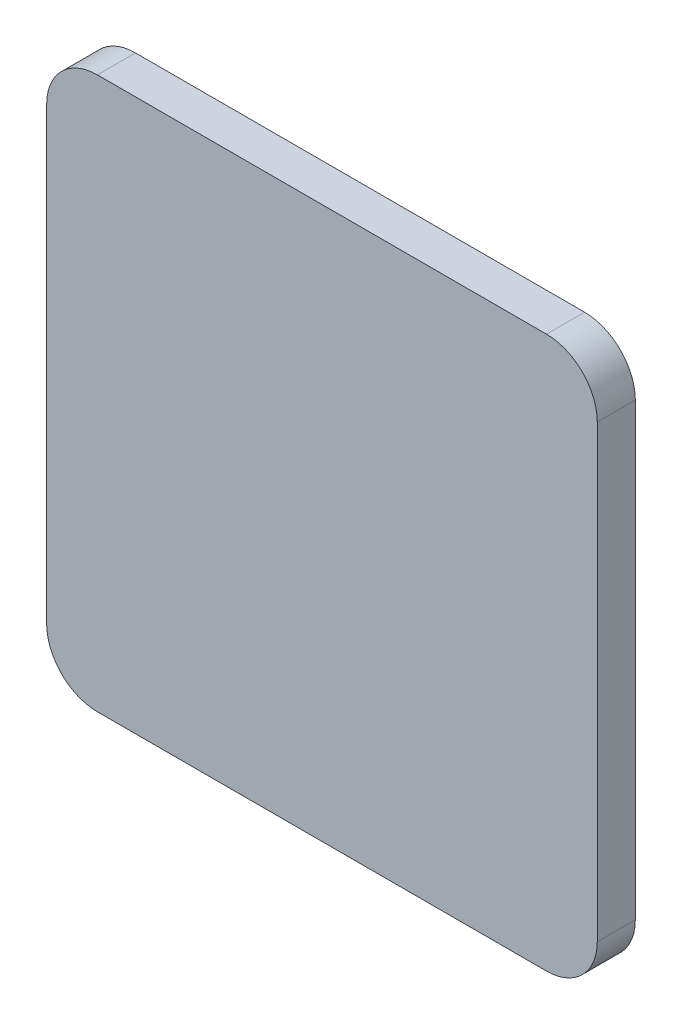
ISO-10303-21;
HEADER;
FILE_DESCRIPTION(('STEP AP214'),'2;1');
FILE_NAME('part.step','',(''),(''),'','','');
FILE_SCHEMA(('AUTOMOTIVE_DESIGN { 1 0 10303 214 1 1 1 1 }'));
ENDSEC;
DATA;
#1=APPLICATION_CONTEXT('core data for automotive mechanical design processes');
#2=APPLICATION_PROTOCOL_DEFINITION('international standard','automotive_design',2000,#1);
#3=PRODUCT_CONTEXT('',#1,'mechanical');
#4=PRODUCT('Part','Part','',(#3));
#5=PRODUCT_RELATED_PRODUCT_CATEGORY('part','',(#4));
#6=PRODUCT_DEFINITION_FORMATION('','',#4);
#7=PRODUCT_DEFINITION_CONTEXT('part definition',#1,'design');
#8=PRODUCT_DEFINITION('design','',#6,#7);
#9=PRODUCT_DEFINITION_SHAPE('','',#8);
#10=(LENGTH_UNIT() NAMED_UNIT(*) SI_UNIT(.MILLI.,.METRE.));
#11=(NAMED_UNIT(*) PLANE_ANGLE_UNIT() SI_UNIT($,.RADIAN.));
#12=(NAMED_UNIT(*) SI_UNIT($,.STERADIAN.) SOLID_ANGLE_UNIT());
#13=UNCERTAINTY_MEASURE_WITH_UNIT(LENGTH_MEASURE(1.E-05),#10,'distance_accuracy_value','');
#14=(GEOMETRIC_REPRESENTATION_CONTEXT(3) GLOBAL_UNCERTAINTY_ASSIGNED_CONTEXT((#13)) GLOBAL_UNIT_ASSIGNED_CONTEXT((#10,
#11,#12)) REPRESENTATION_CONTEXT('',''));
#15=CARTESIAN_POINT('',(0.,0.,0.));
#16=DIRECTION('',(0.,0.,1.));
#17=DIRECTION('',(1.,0.,0.));
#18=AXIS2_PLACEMENT_3D('',#15,#16,#17);
#19=CARTESIAN_POINT('',(0.,0.,1.5));
#20=DIRECTION('',(1.,0.,0.));
#21=DIRECTION('',(0.,0.,-1.));
#22=AXIS2_PLACEMENT_3D('',#19,#20,#21);
#23=PLANE('',#22);
#24=DIRECTION('',(0.,-1.,0.));
#25=VECTOR('',#24,1.);
#26=CARTESIAN_POINT('',(0.,0.,1.5));
#27=LINE('',#26,#25);
#28=CARTESIAN_POINT('',(0.,19.740751921482,1.5));
#29=VERTEX_POINT('',#28);
#30=CARTESIAN_POINT('',(0.,2.,1.5));
#31=VERTEX_POINT('',#30);
#32=EDGE_CURVE('E126',#29,#31,#27,.T.);
#33=ORIENTED_EDGE('',*,*,#32,.F.);
#34=DIRECTION('',(0.,0.,-1.));
#35=VECTOR('',#34,1.);
#36=CARTESIAN_POINT('',(0.,19.740751921482,1.5));
#37=LINE('',#36,#35);
#38=CARTESIAN_POINT('',(0.,19.740751921482,0.));
#39=VERTEX_POINT('',#38);
#40=EDGE_CURVE('E152',#29,#39,#37,.T.);
#41=ORIENTED_EDGE('',*,*,#40,.T.);
#42=DIRECTION('',(0.,-1.,0.));
#43=VECTOR('',#42,1.);
#44=CARTESIAN_POINT('',(0.,0.,0.));
#45=LINE('',#44,#43);
#46=CARTESIAN_POINT('',(0.,2.,0.));
#47=VERTEX_POINT('',#46);
#48=EDGE_CURVE('E158',#39,#47,#45,.T.);
#49=ORIENTED_EDGE('',*,*,#48,.T.);
#50=DIRECTION('',(0.,0.,-1.));
#51=VECTOR('',#50,1.);
#52=CARTESIAN_POINT('',(0.,2.,1.5));
#53=LINE('',#52,#51);
#54=EDGE_CURVE('E150',#47,#31,#53,.F.);
#55=ORIENTED_EDGE('',*,*,#54,.T.);
#56=EDGE_LOOP('',(#33,#41,#49,#55));
#57=FACE_BOUND('',#56,.T.);
#58=ADVANCED_FACE('F34',(#57),#23,.F.);
#59=CARTESIAN_POINT('',(0.,0.,1.5));
#60=DIRECTION('',(0.,1.,0.));
#61=DIRECTION('',(0.,0.,1.));
#62=AXIS2_PLACEMENT_3D('',#59,#60,#61);
#63=PLANE('',#62);
#64=DIRECTION('',(1.,0.,0.));
#65=VECTOR('',#64,1.);
#66=CARTESIAN_POINT('',(0.,0.,1.5));
#67=LINE('',#66,#65);
#68=CARTESIAN_POINT('',(2.,0.,1.5));
#69=VERTEX_POINT('',#68);
#70=CARTESIAN_POINT('',(19.7002476526568,0.,1.5));
#71=VERTEX_POINT('',#70);
#72=EDGE_CURVE('E129',#69,#71,#67,.T.);
#73=ORIENTED_EDGE('',*,*,#72,.F.);
#74=DIRECTION('',(0.,0.,-1.));
#75=VECTOR('',#74,1.);
#76=CARTESIAN_POINT('',(2.,0.,1.5));
#77=LINE('',#76,#75);
#78=CARTESIAN_POINT('',(2.,0.,0.));
#79=VERTEX_POINT('',#78);
#80=EDGE_CURVE('E11',#69,#79,#77,.T.);
#81=ORIENTED_EDGE('',*,*,#80,.T.);
#82=DIRECTION('',(1.,0.,0.));
#83=VECTOR('',#82,1.);
#84=CARTESIAN_POINT('',(0.,0.,0.));
#85=LINE('',#84,#83);
#86=CARTESIAN_POINT('',(19.7002476526568,0.,0.));
#87=VERTEX_POINT('',#86);
#88=EDGE_CURVE('E131',#79,#87,#85,.T.);
#89=ORIENTED_EDGE('',*,*,#88,.T.);
#90=DIRECTION('',(0.,0.,-1.));
#91=VECTOR('',#90,1.);
#92=CARTESIAN_POINT('',(19.7002476526568,0.,1.5));
#93=LINE('',#92,#91);
#94=EDGE_CURVE('E42',#87,#71,#93,.F.);
#95=ORIENTED_EDGE('',*,*,#94,.T.);
#96=EDGE_LOOP('',(#73,#81,#89,#95));
#97=FACE_BOUND('',#96,.T.);
#98=ADVANCED_FACE('F177',(#97),#63,.F.);
#99=CARTESIAN_POINT('',(21.7002476526568,0.,1.5));
#100=DIRECTION('',(-1.,0.,0.));
#101=DIRECTION('',(0.,0.,1.));
#102=AXIS2_PLACEMENT_3D('',#99,#100,#101);
#103=PLANE('',#102);
#104=DIRECTION('',(0.,1.,0.));
#105=VECTOR('',#104,1.);
#106=CARTESIAN_POINT('',(21.7002476526568,0.,0.));
#107=LINE('',#106,#105);
#108=CARTESIAN_POINT('',(21.7002476526568,2.,0.));
#109=VERTEX_POINT('',#108);
#110=CARTESIAN_POINT('',(21.7002476526568,19.740751921482,0.));
#111=VERTEX_POINT('',#110);
#112=EDGE_CURVE('E127',#109,#111,#107,.T.);
#113=ORIENTED_EDGE('',*,*,#112,.T.);
#114=DIRECTION('',(0.,0.,-1.));
#115=VECTOR('',#114,1.);
#116=CARTESIAN_POINT('',(21.7002476526568,19.740751921482,1.5));
#117=LINE('',#116,#115);
#118=CARTESIAN_POINT('',(21.7002476526568,19.740751921482,1.5));
#119=VERTEX_POINT('',#118);
#120=EDGE_CURVE('E105',#111,#119,#117,.F.);
#121=ORIENTED_EDGE('',*,*,#120,.T.);
#122=DIRECTION('',(0.,1.,0.));
#123=VECTOR('',#122,1.);
#124=CARTESIAN_POINT('',(21.7002476526568,0.,1.5));
#125=LINE('',#124,#123);
#126=CARTESIAN_POINT('',(21.7002476526568,2.,1.5));
#127=VERTEX_POINT('',#126);
#128=EDGE_CURVE('E166',#127,#119,#125,.T.);
#129=ORIENTED_EDGE('',*,*,#128,.F.);
#130=DIRECTION('',(0.,0.,-1.));
#131=VECTOR('',#130,1.);
#132=CARTESIAN_POINT('',(21.7002476526568,2.,1.5));
#133=LINE('',#132,#131);
#134=EDGE_CURVE('E110',#127,#109,#133,.T.);
#135=ORIENTED_EDGE('',*,*,#134,.T.);
#136=EDGE_LOOP('',(#113,#121,#129,#135));
#137=FACE_BOUND('',#136,.T.);
#138=ADVANCED_FACE('F176',(#137),#103,.F.);
#139=CARTESIAN_POINT('',(0.,21.740751921482,1.5));
#140=DIRECTION('',(0.,-1.,0.));
#141=DIRECTION('',(0.,0.,-1.));
#142=AXIS2_PLACEMENT_3D('',#139,#140,#141);
#143=PLANE('',#142);
#144=DIRECTION('',(-1.,0.,0.));
#145=VECTOR('',#144,1.);
#146=CARTESIAN_POINT('',(0.,21.740751921482,1.5));
#147=LINE('',#146,#145);
#148=CARTESIAN_POINT('',(19.7002476526568,21.740751921482,1.5));
#149=VERTEX_POINT('',#148);
#150=CARTESIAN_POINT('',(2.,21.740751921482,1.5));
#151=VERTEX_POINT('',#150);
#152=EDGE_CURVE('E120',#149,#151,#147,.T.);
#153=ORIENTED_EDGE('',*,*,#152,.F.);
#154=DIRECTION('',(0.,0.,-1.));
#155=VECTOR('',#154,1.);
#156=CARTESIAN_POINT('',(19.7002476526568,21.740751921482,1.5));
#157=LINE('',#156,#155);
#158=CARTESIAN_POINT('',(19.7002476526568,21.740751921482,0.));
#159=VERTEX_POINT('',#158);
#160=EDGE_CURVE('E104',#149,#159,#157,.T.);
#161=ORIENTED_EDGE('',*,*,#160,.T.);
#162=DIRECTION('',(-1.,0.,0.));
#163=VECTOR('',#162,1.);
#164=CARTESIAN_POINT('',(0.,21.740751921482,0.));
#165=LINE('',#164,#163);
#166=CARTESIAN_POINT('',(2.,21.740751921482,0.));
#167=VERTEX_POINT('',#166);
#168=EDGE_CURVE('E117',#159,#167,#165,.T.);
#169=ORIENTED_EDGE('',*,*,#168,.T.);
#170=DIRECTION('',(0.,0.,-1.));
#171=VECTOR('',#170,1.);
#172=CARTESIAN_POINT('',(2.,21.740751921482,1.5));
#173=LINE('',#172,#171);
#174=EDGE_CURVE('E122',#167,#151,#173,.F.);
#175=ORIENTED_EDGE('',*,*,#174,.T.);
#176=EDGE_LOOP('',(#153,#161,#169,#175));
#177=FACE_BOUND('',#176,.T.);
#178=ADVANCED_FACE('F116',(#177),#143,.F.);
#179=CARTESIAN_POINT('',(0.,0.,1.5));
#180=DIRECTION('',(0.,0.,-1.));
#181=DIRECTION('',(-1.,0.,0.));
#182=AXIS2_PLACEMENT_3D('',#179,#180,#181);
#183=PLANE('',#182);
#184=ORIENTED_EDGE('',*,*,#128,.T.);
#185=CARTESIAN_POINT('',(19.7002476526568,19.740751921482,1.5));
#186=DIRECTION('',(0.,0.,-1.));
#187=DIRECTION('',(-1.,0.,0.));
#188=AXIS2_PLACEMENT_3D('',#185,#186,#187);
#189=CIRCLE('',#188,2.);
#190=EDGE_CURVE('E148',#119,#149,#189,.F.);
#191=ORIENTED_EDGE('',*,*,#190,.T.);
#192=ORIENTED_EDGE('',*,*,#152,.T.);
#193=CARTESIAN_POINT('',(2.,19.740751921482,1.5));
#194=DIRECTION('',(0.,0.,-1.));
#195=DIRECTION('',(-1.,0.,0.));
#196=AXIS2_PLACEMENT_3D('',#193,#194,#195);
#197=CIRCLE('',#196,2.);
#198=EDGE_CURVE('E146',#151,#29,#197,.F.);
#199=ORIENTED_EDGE('',*,*,#198,.T.);
#200=ORIENTED_EDGE('',*,*,#32,.T.);
#201=CARTESIAN_POINT('',(2.,2.,1.5));
#202=DIRECTION('',(0.,0.,-1.));
#203=DIRECTION('',(-1.,0.,0.));
#204=AXIS2_PLACEMENT_3D('',#201,#202,#203);
#205=CIRCLE('',#204,2.);
#206=EDGE_CURVE('E55',#31,#69,#205,.F.);
#207=ORIENTED_EDGE('',*,*,#206,.T.);
#208=ORIENTED_EDGE('',*,*,#72,.T.);
#209=CARTESIAN_POINT('',(19.7002476526568,2.,1.5));
#210=DIRECTION('',(0.,0.,-1.));
#211=DIRECTION('',(-1.,0.,0.));
#212=AXIS2_PLACEMENT_3D('',#209,#210,#211);
#213=CIRCLE('',#212,2.);
#214=EDGE_CURVE('E143',#71,#127,#213,.F.);
#215=ORIENTED_EDGE('',*,*,#214,.T.);
#216=EDGE_LOOP('',(#184,#191,#192,#199,#200,#207,#208,#215));
#217=FACE_BOUND('',#216,.T.);
#218=ADVANCED_FACE('F170',(#217),#183,.F.);
#219=CARTESIAN_POINT('',(0.,0.,0.));
#220=DIRECTION('',(0.,0.,-1.));
#221=DIRECTION('',(-1.,0.,0.));
#222=AXIS2_PLACEMENT_3D('',#219,#220,#221);
#223=PLANE('',#222);
#224=ORIENTED_EDGE('',*,*,#168,.F.);
#225=CARTESIAN_POINT('',(19.7002476526568,19.740751921482,0.));
#226=DIRECTION('',(0.,0.,-1.));
#227=DIRECTION('',(-1.,0.,0.));
#228=AXIS2_PLACEMENT_3D('',#225,#226,#227);
#229=CIRCLE('',#228,2.);
#230=EDGE_CURVE('E100',#159,#111,#229,.T.);
#231=ORIENTED_EDGE('',*,*,#230,.T.);
#232=ORIENTED_EDGE('',*,*,#112,.F.);
#233=CARTESIAN_POINT('',(19.7002476526568,2.,0.));
#234=DIRECTION('',(0.,0.,-1.));
#235=DIRECTION('',(-1.,0.,0.));
#236=AXIS2_PLACEMENT_3D('',#233,#234,#235);
#237=CIRCLE('',#236,2.);
#238=EDGE_CURVE('E121',#109,#87,#237,.T.);
#239=ORIENTED_EDGE('',*,*,#238,.T.);
#240=ORIENTED_EDGE('',*,*,#88,.F.);
#241=CARTESIAN_POINT('',(2.,2.,0.));
#242=DIRECTION('',(0.,0.,-1.));
#243=DIRECTION('',(-1.,0.,0.));
#244=AXIS2_PLACEMENT_3D('',#241,#242,#243);
#245=CIRCLE('',#244,2.);
#246=EDGE_CURVE('E137',#79,#47,#245,.T.);
#247=ORIENTED_EDGE('',*,*,#246,.T.);
#248=ORIENTED_EDGE('',*,*,#48,.F.);
#249=CARTESIAN_POINT('',(2.,19.740751921482,0.));
#250=DIRECTION('',(0.,0.,-1.));
#251=DIRECTION('',(-1.,0.,0.));
#252=AXIS2_PLACEMENT_3D('',#249,#250,#251);
#253=CIRCLE('',#252,2.);
#254=EDGE_CURVE('E111',#39,#167,#253,.T.);
#255=ORIENTED_EDGE('',*,*,#254,.T.);
#256=EDGE_LOOP('',(#224,#231,#232,#239,#240,#247,#248,#255));
#257=FACE_BOUND('',#256,.T.);
#258=ADVANCED_FACE('F124',(#257),#223,.T.);
#259=CARTESIAN_POINT('',(19.7002476526568,19.740751921482,1.5));
#260=DIRECTION('',(0.,0.,-1.));
#261=DIRECTION('',(-1.,0.,0.));
#262=AXIS2_PLACEMENT_3D('',#259,#260,#261);
#263=CYLINDRICAL_SURFACE('',#262,2.);
#264=ORIENTED_EDGE('',*,*,#190,.F.);
#265=ORIENTED_EDGE('',*,*,#120,.F.);
#266=ORIENTED_EDGE('',*,*,#230,.F.);
#267=ORIENTED_EDGE('',*,*,#160,.F.);
#268=EDGE_LOOP('',(#264,#265,#266,#267));
#269=FACE_BOUND('',#268,.T.);
#270=ADVANCED_FACE('F103',(#269),#263,.T.);
#271=CARTESIAN_POINT('',(2.,19.740751921482,1.5));
#272=DIRECTION('',(0.,0.,-1.));
#273=DIRECTION('',(-1.,0.,0.));
#274=AXIS2_PLACEMENT_3D('',#271,#272,#273);
#275=CYLINDRICAL_SURFACE('',#274,2.);
#276=ORIENTED_EDGE('',*,*,#198,.F.);
#277=ORIENTED_EDGE('',*,*,#174,.F.);
#278=ORIENTED_EDGE('',*,*,#254,.F.);
#279=ORIENTED_EDGE('',*,*,#40,.F.);
#280=EDGE_LOOP('',(#276,#277,#278,#279));
#281=FACE_BOUND('',#280,.T.);
#282=ADVANCED_FACE('F180',(#281),#275,.T.);
#283=CARTESIAN_POINT('',(2.,2.,1.5));
#284=DIRECTION('',(0.,0.,-1.));
#285=DIRECTION('',(-1.,0.,0.));
#286=AXIS2_PLACEMENT_3D('',#283,#284,#285);
#287=CYLINDRICAL_SURFACE('',#286,2.);
#288=ORIENTED_EDGE('',*,*,#206,.F.);
#289=ORIENTED_EDGE('',*,*,#54,.F.);
#290=ORIENTED_EDGE('',*,*,#246,.F.);
#291=ORIENTED_EDGE('',*,*,#80,.F.);
#292=EDGE_LOOP('',(#288,#289,#290,#291));
#293=FACE_BOUND('',#292,.T.);
#294=ADVANCED_FACE('F179',(#293),#287,.T.);
#295=CARTESIAN_POINT('',(19.7002476526568,2.,1.5));
#296=DIRECTION('',(0.,0.,-1.));
#297=DIRECTION('',(-1.,0.,0.));
#298=AXIS2_PLACEMENT_3D('',#295,#296,#297);
#299=CYLINDRICAL_SURFACE('',#298,2.);
#300=ORIENTED_EDGE('',*,*,#214,.F.);
#301=ORIENTED_EDGE('',*,*,#94,.F.);
#302=ORIENTED_EDGE('',*,*,#238,.F.);
#303=ORIENTED_EDGE('',*,*,#134,.F.);
#304=EDGE_LOOP('',(#300,#301,#302,#303));
#305=FACE_BOUND('',#304,.T.);
#306=ADVANCED_FACE('F36',(#305),#299,.T.);
#307=CLOSED_SHELL('',(#58,#98,#138,#178,#218,#258,#270,#282,#294,#306));
#308=MANIFOLD_SOLID_BREP('B2',#307);
#309=ADVANCED_BREP_SHAPE_REPRESENTATION('',(#18,#308),#14);
#310=SHAPE_DEFINITION_REPRESENTATION(#9,#309);
ENDSEC;
END-ISO-10303-21;
